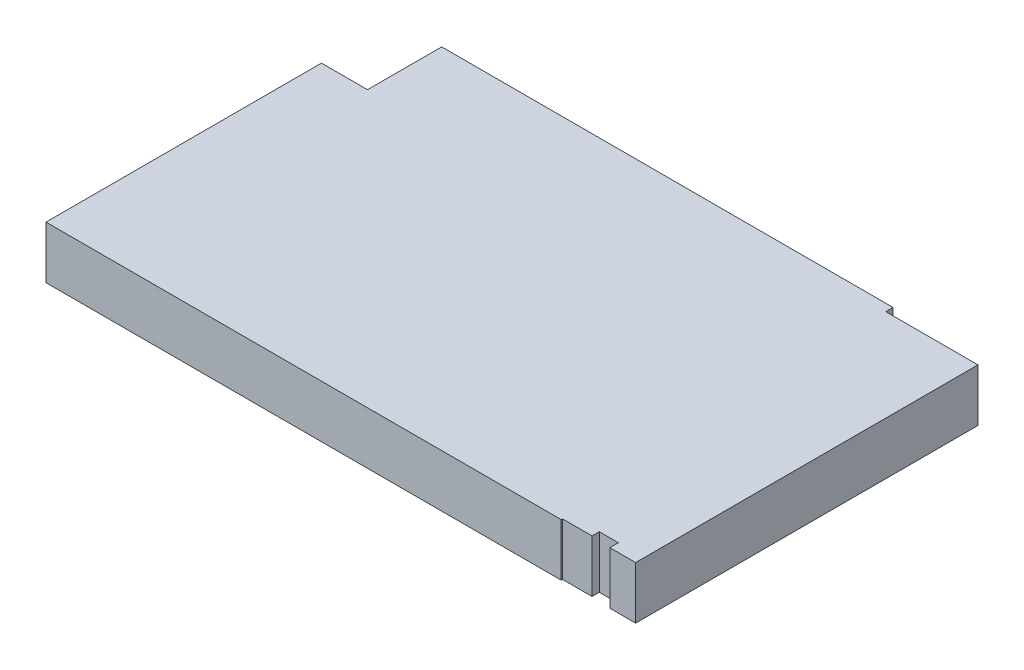
ISO-10303-21;
HEADER;
FILE_DESCRIPTION(('STEP AP214'),'2;1');
FILE_NAME('part.step','',(''),(''),'','','');
FILE_SCHEMA(('AUTOMOTIVE_DESIGN { 1 0 10303 214 1 1 1 1 }'));
ENDSEC;
DATA;
#1=APPLICATION_CONTEXT('core data for automotive mechanical design processes');
#2=APPLICATION_PROTOCOL_DEFINITION('international standard','automotive_design',2000,#1);
#3=PRODUCT_CONTEXT('',#1,'mechanical');
#4=PRODUCT('Part','Part','',(#3));
#5=PRODUCT_RELATED_PRODUCT_CATEGORY('part','',(#4));
#6=PRODUCT_DEFINITION_FORMATION('','',#4);
#7=PRODUCT_DEFINITION_CONTEXT('part definition',#1,'design');
#8=PRODUCT_DEFINITION('design','',#6,#7);
#9=PRODUCT_DEFINITION_SHAPE('','',#8);
#10=(LENGTH_UNIT() NAMED_UNIT(*) SI_UNIT(.MILLI.,.METRE.));
#11=(NAMED_UNIT(*) PLANE_ANGLE_UNIT() SI_UNIT($,.RADIAN.));
#12=(NAMED_UNIT(*) SI_UNIT($,.STERADIAN.) SOLID_ANGLE_UNIT());
#13=UNCERTAINTY_MEASURE_WITH_UNIT(LENGTH_MEASURE(1.E-05),#10,'distance_accuracy_value','');
#14=(GEOMETRIC_REPRESENTATION_CONTEXT(3) GLOBAL_UNCERTAINTY_ASSIGNED_CONTEXT((#13)) GLOBAL_UNIT_ASSIGNED_CONTEXT((#10,
#11,#12)) REPRESENTATION_CONTEXT('',''));
#15=CARTESIAN_POINT('',(0.,0.,0.));
#16=DIRECTION('',(0.,0.,1.));
#17=DIRECTION('',(1.,0.,0.));
#18=AXIS2_PLACEMENT_3D('',#15,#16,#17);
#19=CARTESIAN_POINT('',(142.05,14.47,0.));
#20=DIRECTION('',(0.,0.,-1.));
#21=DIRECTION('',(-1.,0.,0.));
#22=AXIS2_PLACEMENT_3D('',#19,#20,#21);
#23=PLANE('',#22);
#24=DIRECTION('',(1.,0.,0.));
#25=VECTOR('',#24,1.);
#26=CARTESIAN_POINT('',(142.05,0.,0.));
#27=LINE('',#26,#25);
#28=CARTESIAN_POINT('',(0.,0.,0.));
#29=VERTEX_POINT('',#28);
#30=CARTESIAN_POINT('',(142.05,0.,0.));
#31=VERTEX_POINT('',#30);
#32=EDGE_CURVE('E166',#29,#31,#27,.T.);
#33=ORIENTED_EDGE('',*,*,#32,.T.);
#34=DIRECTION('',(0.,-1.,0.));
#35=VECTOR('',#34,1.);
#36=CARTESIAN_POINT('',(142.05,14.47,0.));
#37=LINE('',#36,#35);
#38=CARTESIAN_POINT('',(142.05,14.47,0.));
#39=VERTEX_POINT('',#38);
#40=EDGE_CURVE('E11',#39,#31,#37,.T.);
#41=ORIENTED_EDGE('',*,*,#40,.F.);
#42=DIRECTION('',(1.,0.,0.));
#43=VECTOR('',#42,1.);
#44=CARTESIAN_POINT('',(142.05,14.47,0.));
#45=LINE('',#44,#43);
#46=CARTESIAN_POINT('',(0.,14.47,0.));
#47=VERTEX_POINT('',#46);
#48=EDGE_CURVE('E192',#47,#39,#45,.T.);
#49=ORIENTED_EDGE('',*,*,#48,.F.);
#50=DIRECTION('',(0.,-1.,0.));
#51=VECTOR('',#50,1.);
#52=CARTESIAN_POINT('',(0.,14.47,0.));
#53=LINE('',#52,#51);
#54=EDGE_CURVE('E162',#47,#29,#53,.T.);
#55=ORIENTED_EDGE('',*,*,#54,.T.);
#56=EDGE_LOOP('',(#33,#41,#49,#55));
#57=FACE_BOUND('',#56,.T.);
#58=ADVANCED_FACE('F34',(#57),#23,.F.);
#59=CARTESIAN_POINT('',(142.05,14.47,-0.350000000000015));
#60=DIRECTION('',(-1.,0.,0.));
#61=DIRECTION('',(0.,0.,1.));
#62=AXIS2_PLACEMENT_3D('',#59,#60,#61);
#63=PLANE('',#62);
#64=DIRECTION('',(0.,0.,-1.));
#65=VECTOR('',#64,1.);
#66=CARTESIAN_POINT('',(142.05,0.,-0.350000000000015));
#67=LINE('',#66,#65);
#68=CARTESIAN_POINT('',(142.05,0.,-0.350000000000015));
#69=VERTEX_POINT('',#68);
#70=EDGE_CURVE('E169',#31,#69,#67,.T.);
#71=ORIENTED_EDGE('',*,*,#70,.T.);
#72=DIRECTION('',(0.,-1.,0.));
#73=VECTOR('',#72,1.);
#74=CARTESIAN_POINT('',(142.05,14.47,-0.350000000000015));
#75=LINE('',#74,#73);
#76=CARTESIAN_POINT('',(142.05,14.47,-0.350000000000015));
#77=VERTEX_POINT('',#76);
#78=EDGE_CURVE('E42',#77,#69,#75,.T.);
#79=ORIENTED_EDGE('',*,*,#78,.F.);
#80=DIRECTION('',(0.,0.,-1.));
#81=VECTOR('',#80,1.);
#82=CARTESIAN_POINT('',(142.05,14.47,-0.350000000000015));
#83=LINE('',#82,#81);
#84=EDGE_CURVE('E111',#39,#77,#83,.T.);
#85=ORIENTED_EDGE('',*,*,#84,.F.);
#86=ORIENTED_EDGE('',*,*,#40,.T.);
#87=EDGE_LOOP('',(#71,#79,#85,#86));
#88=FACE_BOUND('',#87,.T.);
#89=ADVANCED_FACE('F280',(#88),#63,.F.);
#90=CARTESIAN_POINT('',(150.2,14.47,-0.350000000000016));
#91=DIRECTION('',(0.,0.,-1.));
#92=DIRECTION('',(-1.,0.,0.));
#93=AXIS2_PLACEMENT_3D('',#90,#91,#92);
#94=PLANE('',#93);
#95=DIRECTION('',(1.,0.,0.));
#96=VECTOR('',#95,1.);
#97=CARTESIAN_POINT('',(150.2,0.,-0.350000000000016));
#98=LINE('',#97,#96);
#99=CARTESIAN_POINT('',(150.2,0.,-0.350000000000016));
#100=VERTEX_POINT('',#99);
#101=EDGE_CURVE('E171',#69,#100,#98,.T.);
#102=ORIENTED_EDGE('',*,*,#101,.T.);
#103=DIRECTION('',(0.,-1.,0.));
#104=VECTOR('',#103,1.);
#105=CARTESIAN_POINT('',(150.2,14.47,-0.350000000000016));
#106=LINE('',#105,#104);
#107=CARTESIAN_POINT('',(150.2,14.47,-0.350000000000016));
#108=VERTEX_POINT('',#107);
#109=EDGE_CURVE('E217',#108,#100,#106,.T.);
#110=ORIENTED_EDGE('',*,*,#109,.F.);
#111=DIRECTION('',(1.,0.,0.));
#112=VECTOR('',#111,1.);
#113=CARTESIAN_POINT('',(150.2,14.47,-0.350000000000016));
#114=LINE('',#113,#112);
#115=EDGE_CURVE('E225',#77,#108,#114,.T.);
#116=ORIENTED_EDGE('',*,*,#115,.F.);
#117=ORIENTED_EDGE('',*,*,#78,.T.);
#118=EDGE_LOOP('',(#102,#110,#116,#117));
#119=FACE_BOUND('',#118,.T.);
#120=ADVANCED_FACE('F223',(#119),#94,.F.);
#121=CARTESIAN_POINT('',(150.2,14.47,-2.35));
#122=DIRECTION('',(-1.,0.,0.));
#123=DIRECTION('',(0.,0.,1.));
#124=AXIS2_PLACEMENT_3D('',#121,#122,#123);
#125=PLANE('',#124);
#126=DIRECTION('',(0.,0.,-1.));
#127=VECTOR('',#126,1.);
#128=CARTESIAN_POINT('',(150.2,0.,-2.35));
#129=LINE('',#128,#127);
#130=CARTESIAN_POINT('',(150.2,0.,-2.35));
#131=VERTEX_POINT('',#130);
#132=EDGE_CURVE('E173',#100,#131,#129,.T.);
#133=ORIENTED_EDGE('',*,*,#132,.T.);
#134=DIRECTION('',(0.,-1.,0.));
#135=VECTOR('',#134,1.);
#136=CARTESIAN_POINT('',(150.2,14.47,-2.35));
#137=LINE('',#136,#135);
#138=CARTESIAN_POINT('',(150.2,14.47,-2.35));
#139=VERTEX_POINT('',#138);
#140=EDGE_CURVE('E214',#139,#131,#137,.T.);
#141=ORIENTED_EDGE('',*,*,#140,.F.);
#142=DIRECTION('',(0.,0.,-1.));
#143=VECTOR('',#142,1.);
#144=CARTESIAN_POINT('',(150.2,14.47,-2.35));
#145=LINE('',#144,#143);
#146=EDGE_CURVE('E243',#108,#139,#145,.T.);
#147=ORIENTED_EDGE('',*,*,#146,.F.);
#148=ORIENTED_EDGE('',*,*,#109,.T.);
#149=EDGE_LOOP('',(#133,#141,#147,#148));
#150=FACE_BOUND('',#149,.T.);
#151=ADVANCED_FACE('F234',(#150),#125,.F.);
#152=CARTESIAN_POINT('',(155.45,14.47,-2.35));
#153=DIRECTION('',(0.,0.,-1.));
#154=DIRECTION('',(-1.,0.,0.));
#155=AXIS2_PLACEMENT_3D('',#152,#153,#154);
#156=PLANE('',#155);
#157=DIRECTION('',(1.,0.,0.));
#158=VECTOR('',#157,1.);
#159=CARTESIAN_POINT('',(155.45,0.,-2.35));
#160=LINE('',#159,#158);
#161=CARTESIAN_POINT('',(155.45,0.,-2.35));
#162=VERTEX_POINT('',#161);
#163=EDGE_CURVE('E175',#131,#162,#160,.T.);
#164=ORIENTED_EDGE('',*,*,#163,.T.);
#165=DIRECTION('',(0.,-1.,0.));
#166=VECTOR('',#165,1.);
#167=CARTESIAN_POINT('',(155.45,14.47,-2.35));
#168=LINE('',#167,#166);
#169=CARTESIAN_POINT('',(155.45,14.47,-2.35));
#170=VERTEX_POINT('',#169);
#171=EDGE_CURVE('E211',#170,#162,#168,.T.);
#172=ORIENTED_EDGE('',*,*,#171,.F.);
#173=DIRECTION('',(1.,0.,0.));
#174=VECTOR('',#173,1.);
#175=CARTESIAN_POINT('',(155.45,14.47,-2.35));
#176=LINE('',#175,#174);
#177=EDGE_CURVE('E240',#139,#170,#176,.T.);
#178=ORIENTED_EDGE('',*,*,#177,.F.);
#179=ORIENTED_EDGE('',*,*,#140,.T.);
#180=EDGE_LOOP('',(#164,#172,#178,#179));
#181=FACE_BOUND('',#180,.T.);
#182=ADVANCED_FACE('F238',(#181),#156,.F.);
#183=CARTESIAN_POINT('',(155.45,14.47,0.));
#184=DIRECTION('',(1.,0.,0.));
#185=DIRECTION('',(0.,0.,-1.));
#186=AXIS2_PLACEMENT_3D('',#183,#184,#185);
#187=PLANE('',#186);
#188=DIRECTION('',(0.,0.,1.));
#189=VECTOR('',#188,1.);
#190=CARTESIAN_POINT('',(155.45,0.,0.));
#191=LINE('',#190,#189);
#192=CARTESIAN_POINT('',(155.45,0.,0.));
#193=VERTEX_POINT('',#192);
#194=EDGE_CURVE('E177',#162,#193,#191,.T.);
#195=ORIENTED_EDGE('',*,*,#194,.T.);
#196=DIRECTION('',(0.,-1.,0.));
#197=VECTOR('',#196,1.);
#198=CARTESIAN_POINT('',(155.45,14.47,0.));
#199=LINE('',#198,#197);
#200=CARTESIAN_POINT('',(155.45,14.47,0.));
#201=VERTEX_POINT('',#200);
#202=EDGE_CURVE('E208',#201,#193,#199,.T.);
#203=ORIENTED_EDGE('',*,*,#202,.F.);
#204=DIRECTION('',(0.,0.,1.));
#205=VECTOR('',#204,1.);
#206=CARTESIAN_POINT('',(155.45,14.47,0.));
#207=LINE('',#206,#205);
#208=EDGE_CURVE('E242',#170,#201,#207,.T.);
#209=ORIENTED_EDGE('',*,*,#208,.F.);
#210=ORIENTED_EDGE('',*,*,#171,.T.);
#211=EDGE_LOOP('',(#195,#203,#209,#210));
#212=FACE_BOUND('',#211,.T.);
#213=ADVANCED_FACE('F293',(#212),#187,.F.);
#214=CARTESIAN_POINT('',(162.57,14.47,0.));
#215=DIRECTION('',(0.,0.,-1.));
#216=DIRECTION('',(-1.,0.,0.));
#217=AXIS2_PLACEMENT_3D('',#214,#215,#216);
#218=PLANE('',#217);
#219=DIRECTION('',(1.,0.,0.));
#220=VECTOR('',#219,1.);
#221=CARTESIAN_POINT('',(162.57,0.,0.));
#222=LINE('',#221,#220);
#223=CARTESIAN_POINT('',(162.57,0.,0.));
#224=VERTEX_POINT('',#223);
#225=EDGE_CURVE('E179',#193,#224,#222,.T.);
#226=ORIENTED_EDGE('',*,*,#225,.T.);
#227=DIRECTION('',(0.,-1.,0.));
#228=VECTOR('',#227,1.);
#229=CARTESIAN_POINT('',(162.57,14.47,0.));
#230=LINE('',#229,#228);
#231=CARTESIAN_POINT('',(162.57,14.47,0.));
#232=VERTEX_POINT('',#231);
#233=EDGE_CURVE('E205',#232,#224,#230,.T.);
#234=ORIENTED_EDGE('',*,*,#233,.F.);
#235=DIRECTION('',(1.,0.,0.));
#236=VECTOR('',#235,1.);
#237=CARTESIAN_POINT('',(162.57,14.47,0.));
#238=LINE('',#237,#236);
#239=EDGE_CURVE('E245',#201,#232,#238,.T.);
#240=ORIENTED_EDGE('',*,*,#239,.F.);
#241=ORIENTED_EDGE('',*,*,#202,.T.);
#242=EDGE_LOOP('',(#226,#234,#240,#241));
#243=FACE_BOUND('',#242,.T.);
#244=ADVANCED_FACE('F296',(#243),#218,.F.);
#245=CARTESIAN_POINT('',(162.57,14.47,-94.4));
#246=DIRECTION('',(-1.,0.,0.));
#247=DIRECTION('',(0.,0.,1.));
#248=AXIS2_PLACEMENT_3D('',#245,#246,#247);
#249=PLANE('',#248);
#250=DIRECTION('',(0.,0.,-1.));
#251=VECTOR('',#250,1.);
#252=CARTESIAN_POINT('',(162.57,0.,-94.4));
#253=LINE('',#252,#251);
#254=CARTESIAN_POINT('',(162.57,0.,-94.4));
#255=VERTEX_POINT('',#254);
#256=EDGE_CURVE('E181',#224,#255,#253,.T.);
#257=ORIENTED_EDGE('',*,*,#256,.T.);
#258=DIRECTION('',(0.,-1.,0.));
#259=VECTOR('',#258,1.);
#260=CARTESIAN_POINT('',(162.57,14.47,-94.4));
#261=LINE('',#260,#259);
#262=CARTESIAN_POINT('',(162.57,14.47,-94.4));
#263=VERTEX_POINT('',#262);
#264=EDGE_CURVE('E202',#263,#255,#261,.T.);
#265=ORIENTED_EDGE('',*,*,#264,.F.);
#266=DIRECTION('',(0.,0.,-1.));
#267=VECTOR('',#266,1.);
#268=CARTESIAN_POINT('',(162.57,14.47,-94.4));
#269=LINE('',#268,#267);
#270=EDGE_CURVE('E251',#232,#263,#269,.T.);
#271=ORIENTED_EDGE('',*,*,#270,.F.);
#272=ORIENTED_EDGE('',*,*,#233,.T.);
#273=EDGE_LOOP('',(#257,#265,#271,#272));
#274=FACE_BOUND('',#273,.T.);
#275=ADVANCED_FACE('F300',(#274),#249,.F.);
#276=CARTESIAN_POINT('',(137.15,14.47,-94.4));
#277=DIRECTION('',(0.,0.,1.));
#278=DIRECTION('',(1.,0.,0.));
#279=AXIS2_PLACEMENT_3D('',#276,#277,#278);
#280=PLANE('',#279);
#281=DIRECTION('',(-1.,0.,0.));
#282=VECTOR('',#281,1.);
#283=CARTESIAN_POINT('',(137.15,0.,-94.4));
#284=LINE('',#283,#282);
#285=CARTESIAN_POINT('',(137.15,0.,-94.4));
#286=VERTEX_POINT('',#285);
#287=EDGE_CURVE('E183',#255,#286,#284,.T.);
#288=ORIENTED_EDGE('',*,*,#287,.T.);
#289=DIRECTION('',(0.,-1.,0.));
#290=VECTOR('',#289,1.);
#291=CARTESIAN_POINT('',(137.15,14.47,-94.4));
#292=LINE('',#291,#290);
#293=CARTESIAN_POINT('',(137.15,14.47,-94.4));
#294=VERTEX_POINT('',#293);
#295=EDGE_CURVE('E199',#294,#286,#292,.T.);
#296=ORIENTED_EDGE('',*,*,#295,.F.);
#297=DIRECTION('',(-1.,0.,0.));
#298=VECTOR('',#297,1.);
#299=CARTESIAN_POINT('',(137.15,14.47,-94.4));
#300=LINE('',#299,#298);
#301=EDGE_CURVE('E253',#263,#294,#300,.T.);
#302=ORIENTED_EDGE('',*,*,#301,.F.);
#303=ORIENTED_EDGE('',*,*,#264,.T.);
#304=EDGE_LOOP('',(#288,#296,#302,#303));
#305=FACE_BOUND('',#304,.T.);
#306=ADVANCED_FACE('F304',(#305),#280,.F.);
#307=CARTESIAN_POINT('',(137.15,14.47,-96.4));
#308=DIRECTION('',(-1.,0.,0.));
#309=DIRECTION('',(0.,0.,1.));
#310=AXIS2_PLACEMENT_3D('',#307,#308,#309);
#311=PLANE('',#310);
#312=DIRECTION('',(0.,0.,-1.));
#313=VECTOR('',#312,1.);
#314=CARTESIAN_POINT('',(137.15,0.,-96.4));
#315=LINE('',#314,#313);
#316=CARTESIAN_POINT('',(137.15,0.,-96.4));
#317=VERTEX_POINT('',#316);
#318=EDGE_CURVE('E185',#286,#317,#315,.T.);
#319=ORIENTED_EDGE('',*,*,#318,.T.);
#320=DIRECTION('',(0.,-1.,0.));
#321=VECTOR('',#320,1.);
#322=CARTESIAN_POINT('',(137.15,14.47,-96.4));
#323=LINE('',#322,#321);
#324=CARTESIAN_POINT('',(137.15,14.47,-96.4));
#325=VERTEX_POINT('',#324);
#326=EDGE_CURVE('E196',#325,#317,#323,.T.);
#327=ORIENTED_EDGE('',*,*,#326,.F.);
#328=DIRECTION('',(0.,0.,-1.));
#329=VECTOR('',#328,1.);
#330=CARTESIAN_POINT('',(137.15,14.47,-96.4));
#331=LINE('',#330,#329);
#332=EDGE_CURVE('E255',#294,#325,#331,.T.);
#333=ORIENTED_EDGE('',*,*,#332,.F.);
#334=ORIENTED_EDGE('',*,*,#295,.T.);
#335=EDGE_LOOP('',(#319,#327,#333,#334));
#336=FACE_BOUND('',#335,.T.);
#337=ADVANCED_FACE('F261',(#336),#311,.F.);
#338=CARTESIAN_POINT('',(12.7,14.47,-96.4));
#339=DIRECTION('',(0.,0.,1.));
#340=DIRECTION('',(1.,0.,0.));
#341=AXIS2_PLACEMENT_3D('',#338,#339,#340);
#342=PLANE('',#341);
#343=DIRECTION('',(-1.,0.,0.));
#344=VECTOR('',#343,1.);
#345=CARTESIAN_POINT('',(12.7,0.,-96.4));
#346=LINE('',#345,#344);
#347=CARTESIAN_POINT('',(12.7,0.,-96.4));
#348=VERTEX_POINT('',#347);
#349=EDGE_CURVE('E187',#317,#348,#346,.T.);
#350=ORIENTED_EDGE('',*,*,#349,.T.);
#351=DIRECTION('',(0.,-1.,0.));
#352=VECTOR('',#351,1.);
#353=CARTESIAN_POINT('',(12.7,14.47,-96.4));
#354=LINE('',#353,#352);
#355=CARTESIAN_POINT('',(12.7,14.47,-96.4));
#356=VERTEX_POINT('',#355);
#357=EDGE_CURVE('E157',#356,#348,#354,.T.);
#358=ORIENTED_EDGE('',*,*,#357,.F.);
#359=DIRECTION('',(-1.,0.,0.));
#360=VECTOR('',#359,1.);
#361=CARTESIAN_POINT('',(12.7,14.47,-96.4));
#362=LINE('',#361,#360);
#363=EDGE_CURVE('E148',#325,#356,#362,.T.);
#364=ORIENTED_EDGE('',*,*,#363,.F.);
#365=ORIENTED_EDGE('',*,*,#326,.T.);
#366=EDGE_LOOP('',(#350,#358,#364,#365));
#367=FACE_BOUND('',#366,.T.);
#368=ADVANCED_FACE('F265',(#367),#342,.F.);
#369=CARTESIAN_POINT('',(12.7,14.47,-75.95));
#370=DIRECTION('',(1.,0.,0.));
#371=DIRECTION('',(0.,0.,-1.));
#372=AXIS2_PLACEMENT_3D('',#369,#370,#371);
#373=PLANE('',#372);
#374=DIRECTION('',(0.,0.,1.));
#375=VECTOR('',#374,1.);
#376=CARTESIAN_POINT('',(12.7,0.,-75.95));
#377=LINE('',#376,#375);
#378=CARTESIAN_POINT('',(12.7,0.,-75.95));
#379=VERTEX_POINT('',#378);
#380=EDGE_CURVE('E156',#348,#379,#377,.T.);
#381=ORIENTED_EDGE('',*,*,#380,.T.);
#382=DIRECTION('',(0.,-1.,0.));
#383=VECTOR('',#382,1.);
#384=CARTESIAN_POINT('',(12.7,14.47,-75.95));
#385=LINE('',#384,#383);
#386=CARTESIAN_POINT('',(12.7,14.47,-75.95));
#387=VERTEX_POINT('',#386);
#388=EDGE_CURVE('E153',#387,#379,#385,.T.);
#389=ORIENTED_EDGE('',*,*,#388,.F.);
#390=DIRECTION('',(0.,0.,1.));
#391=VECTOR('',#390,1.);
#392=CARTESIAN_POINT('',(12.7,14.47,-75.95));
#393=LINE('',#392,#391);
#394=EDGE_CURVE('E142',#356,#387,#393,.T.);
#395=ORIENTED_EDGE('',*,*,#394,.F.);
#396=ORIENTED_EDGE('',*,*,#357,.T.);
#397=EDGE_LOOP('',(#381,#389,#395,#396));
#398=FACE_BOUND('',#397,.T.);
#399=ADVANCED_FACE('F154',(#398),#373,.F.);
#400=CARTESIAN_POINT('',(0.,14.47,-75.95));
#401=DIRECTION('',(0.,0.,1.));
#402=DIRECTION('',(1.,0.,0.));
#403=AXIS2_PLACEMENT_3D('',#400,#401,#402);
#404=PLANE('',#403);
#405=DIRECTION('',(-1.,0.,0.));
#406=VECTOR('',#405,1.);
#407=CARTESIAN_POINT('',(0.,0.,-75.95));
#408=LINE('',#407,#406);
#409=CARTESIAN_POINT('',(0.,0.,-75.95));
#410=VERTEX_POINT('',#409);
#411=EDGE_CURVE('E97',#379,#410,#408,.T.);
#412=ORIENTED_EDGE('',*,*,#411,.T.);
#413=DIRECTION('',(0.,-1.,0.));
#414=VECTOR('',#413,1.);
#415=CARTESIAN_POINT('',(0.,14.47,-75.95));
#416=LINE('',#415,#414);
#417=CARTESIAN_POINT('',(0.,14.47,-75.95));
#418=VERTEX_POINT('',#417);
#419=EDGE_CURVE('E158',#418,#410,#416,.T.);
#420=ORIENTED_EDGE('',*,*,#419,.F.);
#421=DIRECTION('',(-1.,0.,0.));
#422=VECTOR('',#421,1.);
#423=CARTESIAN_POINT('',(0.,14.47,-75.95));
#424=LINE('',#423,#422);
#425=EDGE_CURVE('E146',#387,#418,#424,.T.);
#426=ORIENTED_EDGE('',*,*,#425,.F.);
#427=ORIENTED_EDGE('',*,*,#388,.T.);
#428=EDGE_LOOP('',(#412,#420,#426,#427));
#429=FACE_BOUND('',#428,.T.);
#430=ADVANCED_FACE('F160',(#429),#404,.F.);
#431=CARTESIAN_POINT('',(0.,14.47,0.));
#432=DIRECTION('',(1.,0.,0.));
#433=DIRECTION('',(0.,0.,-1.));
#434=AXIS2_PLACEMENT_3D('',#431,#432,#433);
#435=PLANE('',#434);
#436=DIRECTION('',(0.,0.,1.));
#437=VECTOR('',#436,1.);
#438=CARTESIAN_POINT('',(0.,0.,0.));
#439=LINE('',#438,#437);
#440=EDGE_CURVE('E103',#410,#29,#439,.T.);
#441=ORIENTED_EDGE('',*,*,#440,.T.);
#442=ORIENTED_EDGE('',*,*,#54,.F.);
#443=DIRECTION('',(0.,0.,1.));
#444=VECTOR('',#443,1.);
#445=CARTESIAN_POINT('',(0.,14.47,0.));
#446=LINE('',#445,#444);
#447=EDGE_CURVE('E50',#418,#47,#446,.T.);
#448=ORIENTED_EDGE('',*,*,#447,.F.);
#449=ORIENTED_EDGE('',*,*,#419,.T.);
#450=EDGE_LOOP('',(#441,#442,#448,#449));
#451=FACE_BOUND('',#450,.T.);
#452=ADVANCED_FACE('F269',(#451),#435,.F.);
#453=CARTESIAN_POINT('',(0.,14.47,0.));
#454=DIRECTION('',(0.,-1.,0.));
#455=DIRECTION('',(0.,0.,-1.));
#456=AXIS2_PLACEMENT_3D('',#453,#454,#455);
#457=PLANE('',#456);
#458=ORIENTED_EDGE('',*,*,#48,.T.);
#459=ORIENTED_EDGE('',*,*,#84,.T.);
#460=ORIENTED_EDGE('',*,*,#115,.T.);
#461=ORIENTED_EDGE('',*,*,#146,.T.);
#462=ORIENTED_EDGE('',*,*,#177,.T.);
#463=ORIENTED_EDGE('',*,*,#208,.T.);
#464=ORIENTED_EDGE('',*,*,#239,.T.);
#465=ORIENTED_EDGE('',*,*,#270,.T.);
#466=ORIENTED_EDGE('',*,*,#301,.T.);
#467=ORIENTED_EDGE('',*,*,#332,.T.);
#468=ORIENTED_EDGE('',*,*,#363,.T.);
#469=ORIENTED_EDGE('',*,*,#394,.T.);
#470=ORIENTED_EDGE('',*,*,#425,.T.);
#471=ORIENTED_EDGE('',*,*,#447,.T.);
#472=EDGE_LOOP('',(#458,#459,#460,#461,#462,#463,#464,#465,#466,#467,#468,#469,#470,#471));
#473=FACE_BOUND('',#472,.T.);
#474=ADVANCED_FACE('F144',(#473),#457,.F.);
#475=CARTESIAN_POINT('',(0.,0.,0.));
#476=DIRECTION('',(0.,-1.,0.));
#477=DIRECTION('',(0.,0.,-1.));
#478=AXIS2_PLACEMENT_3D('',#475,#476,#477);
#479=PLANE('',#478);
#480=ORIENTED_EDGE('',*,*,#32,.F.);
#481=ORIENTED_EDGE('',*,*,#440,.F.);
#482=ORIENTED_EDGE('',*,*,#411,.F.);
#483=ORIENTED_EDGE('',*,*,#380,.F.);
#484=ORIENTED_EDGE('',*,*,#349,.F.);
#485=ORIENTED_EDGE('',*,*,#318,.F.);
#486=ORIENTED_EDGE('',*,*,#287,.F.);
#487=ORIENTED_EDGE('',*,*,#256,.F.);
#488=ORIENTED_EDGE('',*,*,#225,.F.);
#489=ORIENTED_EDGE('',*,*,#194,.F.);
#490=ORIENTED_EDGE('',*,*,#163,.F.);
#491=ORIENTED_EDGE('',*,*,#132,.F.);
#492=ORIENTED_EDGE('',*,*,#101,.F.);
#493=ORIENTED_EDGE('',*,*,#70,.F.);
#494=EDGE_LOOP('',(#480,#481,#482,#483,#484,#485,#486,#487,#488,#489,#490,#491,#492,#493));
#495=FACE_BOUND('',#494,.T.);
#496=ADVANCED_FACE('F229',(#495),#479,.T.);
#497=CLOSED_SHELL('',(#58,#89,#120,#151,#182,#213,#244,#275,#306,#337,#368,#399,#430,#452,#474,#496));
#498=MANIFOLD_SOLID_BREP('B2',#497);
#499=ADVANCED_BREP_SHAPE_REPRESENTATION('',(#18,#498),#14);
#500=SHAPE_DEFINITION_REPRESENTATION(#9,#499);
ENDSEC;
END-ISO-10303-21;
